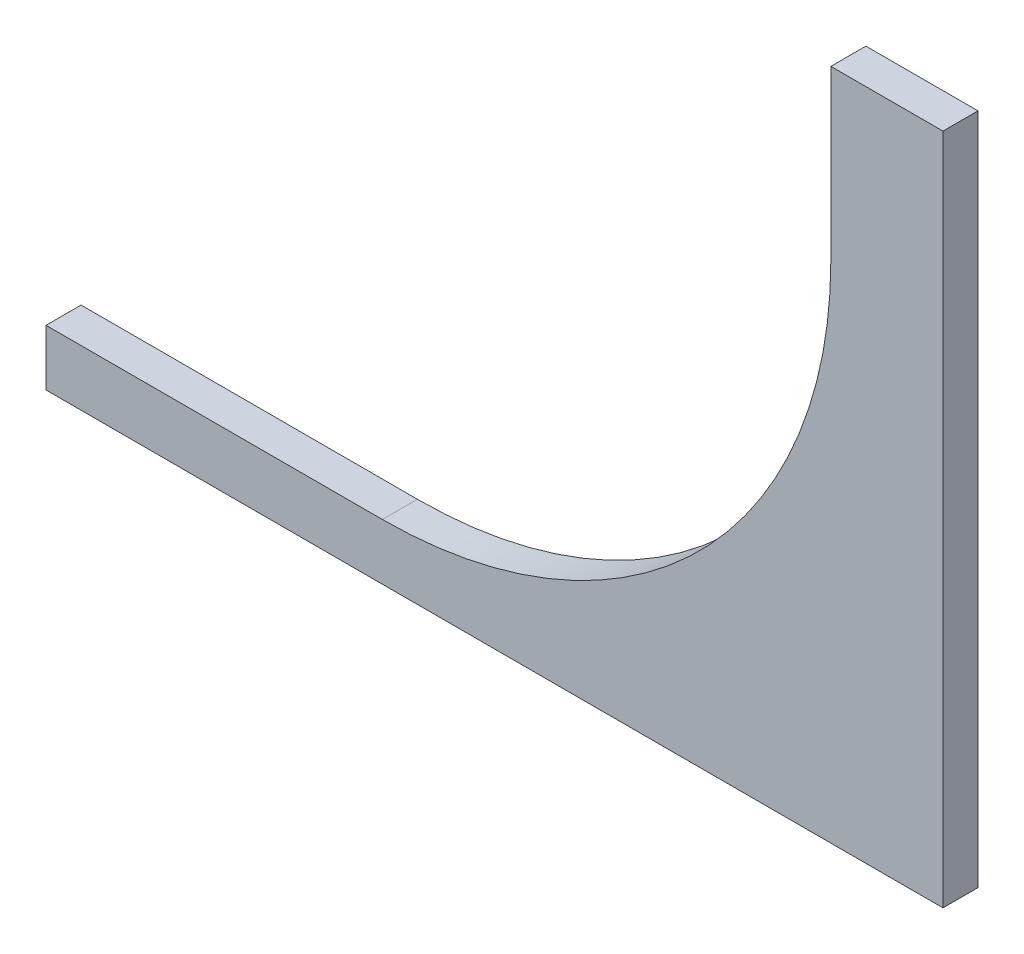
ISO-10303-21;
HEADER;
FILE_DESCRIPTION(('STEP AP214'),'2;1');
FILE_NAME('part.step','',(''),(''),'','','');
FILE_SCHEMA(('AUTOMOTIVE_DESIGN { 1 0 10303 214 1 1 1 1 }'));
ENDSEC;
DATA;
#1=APPLICATION_CONTEXT('core data for automotive mechanical design processes');
#2=APPLICATION_PROTOCOL_DEFINITION('international standard','automotive_design',2000,#1);
#3=PRODUCT_CONTEXT('',#1,'mechanical');
#4=PRODUCT('Part','Part','',(#3));
#5=PRODUCT_RELATED_PRODUCT_CATEGORY('part','',(#4));
#6=PRODUCT_DEFINITION_FORMATION('','',#4);
#7=PRODUCT_DEFINITION_CONTEXT('part definition',#1,'design');
#8=PRODUCT_DEFINITION('design','',#6,#7);
#9=PRODUCT_DEFINITION_SHAPE('','',#8);
#10=(LENGTH_UNIT() NAMED_UNIT(*) SI_UNIT(.MILLI.,.METRE.));
#11=(NAMED_UNIT(*) PLANE_ANGLE_UNIT() SI_UNIT($,.RADIAN.));
#12=(NAMED_UNIT(*) SI_UNIT($,.STERADIAN.) SOLID_ANGLE_UNIT());
#13=UNCERTAINTY_MEASURE_WITH_UNIT(LENGTH_MEASURE(1.E-05),#10,'distance_accuracy_value','');
#14=(GEOMETRIC_REPRESENTATION_CONTEXT(3) GLOBAL_UNCERTAINTY_ASSIGNED_CONTEXT((#13)) GLOBAL_UNIT_ASSIGNED_CONTEXT((#10,
#11,#12)) REPRESENTATION_CONTEXT('',''));
#15=CARTESIAN_POINT('',(0.,0.,0.));
#16=DIRECTION('',(0.,0.,1.));
#17=DIRECTION('',(1.,0.,0.));
#18=AXIS2_PLACEMENT_3D('',#15,#16,#17);
#19=CARTESIAN_POINT('',(0.,0.,15.875));
#20=DIRECTION('',(1.,0.,0.));
#21=DIRECTION('',(0.,0.,-1.));
#22=AXIS2_PLACEMENT_3D('',#19,#20,#21);
#23=PLANE('',#22);
#24=DIRECTION('',(0.,-1.,0.));
#25=VECTOR('',#24,1.);
#26=CARTESIAN_POINT('',(0.,0.,15.875));
#27=LINE('',#26,#25);
#28=CARTESIAN_POINT('',(0.,25.4,15.875));
#29=VERTEX_POINT('',#28);
#30=CARTESIAN_POINT('',(0.,0.,15.875));
#31=VERTEX_POINT('',#30);
#32=EDGE_CURVE('E77',#29,#31,#27,.T.);
#33=ORIENTED_EDGE('',*,*,#32,.F.);
#34=DIRECTION('',(0.,0.,1.));
#35=VECTOR('',#34,1.);
#36=CARTESIAN_POINT('',(0.,25.4,0.));
#37=LINE('',#36,#35);
#38=CARTESIAN_POINT('',(0.,25.4,0.));
#39=VERTEX_POINT('',#38);
#40=EDGE_CURVE('E103',#39,#29,#37,.T.);
#41=ORIENTED_EDGE('',*,*,#40,.F.);
#42=DIRECTION('',(0.,-1.,0.));
#43=VECTOR('',#42,1.);
#44=CARTESIAN_POINT('',(0.,0.,0.));
#45=LINE('',#44,#43);
#46=CARTESIAN_POINT('',(0.,0.,0.));
#47=VERTEX_POINT('',#46);
#48=EDGE_CURVE('E111',#39,#47,#45,.T.);
#49=ORIENTED_EDGE('',*,*,#48,.T.);
#50=DIRECTION('',(0.,0.,-1.));
#51=VECTOR('',#50,1.);
#52=CARTESIAN_POINT('',(0.,0.,15.875));
#53=LINE('',#52,#51);
#54=EDGE_CURVE('E11',#31,#47,#53,.T.);
#55=ORIENTED_EDGE('',*,*,#54,.F.);
#56=EDGE_LOOP('',(#33,#41,#49,#55));
#57=FACE_BOUND('',#56,.T.);
#58=ADVANCED_FACE('F32',(#57),#23,.F.);
#59=CARTESIAN_POINT('',(0.,0.,15.875));
#60=DIRECTION('',(0.,1.,0.));
#61=DIRECTION('',(0.,0.,1.));
#62=AXIS2_PLACEMENT_3D('',#59,#60,#61);
#63=PLANE('',#62);
#64=DIRECTION('',(1.,0.,0.));
#65=VECTOR('',#64,1.);
#66=CARTESIAN_POINT('',(0.,0.,0.));
#67=LINE('',#66,#65);
#68=CARTESIAN_POINT('',(406.4,0.,0.));
#69=VERTEX_POINT('',#68);
#70=EDGE_CURVE('E117',#47,#69,#67,.T.);
#71=ORIENTED_EDGE('',*,*,#70,.T.);
#72=DIRECTION('',(0.,0.,-1.));
#73=VECTOR('',#72,1.);
#74=CARTESIAN_POINT('',(406.4,0.,15.875));
#75=LINE('',#74,#73);
#76=CARTESIAN_POINT('',(406.4,0.,15.875));
#77=VERTEX_POINT('',#76);
#78=EDGE_CURVE('E39',#77,#69,#75,.T.);
#79=ORIENTED_EDGE('',*,*,#78,.F.);
#80=DIRECTION('',(1.,0.,0.));
#81=VECTOR('',#80,1.);
#82=CARTESIAN_POINT('',(0.,0.,15.875));
#83=LINE('',#82,#81);
#84=EDGE_CURVE('E142',#31,#77,#83,.T.);
#85=ORIENTED_EDGE('',*,*,#84,.F.);
#86=ORIENTED_EDGE('',*,*,#54,.T.);
#87=EDGE_LOOP('',(#71,#79,#85,#86));
#88=FACE_BOUND('',#87,.T.);
#89=ADVANCED_FACE('F169',(#88),#63,.F.);
#90=CARTESIAN_POINT('',(406.4,0.,15.875));
#91=DIRECTION('',(-1.,0.,0.));
#92=DIRECTION('',(0.,0.,1.));
#93=AXIS2_PLACEMENT_3D('',#90,#91,#92);
#94=PLANE('',#93);
#95=DIRECTION('',(0.,1.,0.));
#96=VECTOR('',#95,1.);
#97=CARTESIAN_POINT('',(406.4,0.,0.));
#98=LINE('',#97,#96);
#99=CARTESIAN_POINT('',(406.4,304.8,0.));
#100=VERTEX_POINT('',#99);
#101=EDGE_CURVE('E72',#69,#100,#98,.T.);
#102=ORIENTED_EDGE('',*,*,#101,.T.);
#103=DIRECTION('',(0.,0.,-1.));
#104=VECTOR('',#103,1.);
#105=CARTESIAN_POINT('',(406.4,304.8,15.875));
#106=LINE('',#105,#104);
#107=CARTESIAN_POINT('',(406.4,304.8,15.875));
#108=VERTEX_POINT('',#107);
#109=EDGE_CURVE('E132',#108,#100,#106,.T.);
#110=ORIENTED_EDGE('',*,*,#109,.F.);
#111=DIRECTION('',(0.,1.,0.));
#112=VECTOR('',#111,1.);
#113=CARTESIAN_POINT('',(406.4,0.,15.875));
#114=LINE('',#113,#112);
#115=EDGE_CURVE('E55',#77,#108,#114,.T.);
#116=ORIENTED_EDGE('',*,*,#115,.F.);
#117=ORIENTED_EDGE('',*,*,#78,.T.);
#118=EDGE_LOOP('',(#102,#110,#116,#117));
#119=FACE_BOUND('',#118,.T.);
#120=ADVANCED_FACE('F134',(#119),#94,.F.);
#121=CARTESIAN_POINT('',(0.,304.8,15.875));
#122=DIRECTION('',(0.,-1.,0.));
#123=DIRECTION('',(0.,0.,-1.));
#124=AXIS2_PLACEMENT_3D('',#121,#122,#123);
#125=PLANE('',#124);
#126=DIRECTION('',(-1.,0.,0.));
#127=VECTOR('',#126,1.);
#128=CARTESIAN_POINT('',(0.,304.8,0.));
#129=LINE('',#128,#127);
#130=CARTESIAN_POINT('',(355.6,304.8,0.));
#131=VERTEX_POINT('',#130);
#132=EDGE_CURVE('E129',#100,#131,#129,.T.);
#133=ORIENTED_EDGE('',*,*,#132,.T.);
#134=DIRECTION('',(0.,0.,1.));
#135=VECTOR('',#134,1.);
#136=CARTESIAN_POINT('',(355.6,304.8,0.));
#137=LINE('',#136,#135);
#138=CARTESIAN_POINT('',(355.6,304.8,15.875));
#139=VERTEX_POINT('',#138);
#140=EDGE_CURVE('E118',#131,#139,#137,.T.);
#141=ORIENTED_EDGE('',*,*,#140,.T.);
#142=DIRECTION('',(-1.,0.,0.));
#143=VECTOR('',#142,1.);
#144=CARTESIAN_POINT('',(0.,304.8,15.875));
#145=LINE('',#144,#143);
#146=EDGE_CURVE('E125',#108,#139,#145,.T.);
#147=ORIENTED_EDGE('',*,*,#146,.F.);
#148=ORIENTED_EDGE('',*,*,#109,.T.);
#149=EDGE_LOOP('',(#133,#141,#147,#148));
#150=FACE_BOUND('',#149,.T.);
#151=ADVANCED_FACE('F139',(#150),#125,.F.);
#152=CARTESIAN_POINT('',(0.,0.,15.875));
#153=DIRECTION('',(0.,0.,-1.));
#154=DIRECTION('',(-1.,0.,0.));
#155=AXIS2_PLACEMENT_3D('',#152,#153,#154);
#156=PLANE('',#155);
#157=ORIENTED_EDGE('',*,*,#146,.T.);
#158=DIRECTION('',(0.,1.,0.));
#159=VECTOR('',#158,1.);
#160=CARTESIAN_POINT('',(355.6,228.6,15.875));
#161=LINE('',#160,#159);
#162=CARTESIAN_POINT('',(355.6,228.6,15.875));
#163=VERTEX_POINT('',#162);
#164=EDGE_CURVE('E107',#163,#139,#161,.T.);
#165=ORIENTED_EDGE('',*,*,#164,.F.);
#166=CARTESIAN_POINT('',(152.4,228.6,15.875));
#167=DIRECTION('',(0.,0.,1.));
#168=DIRECTION('',(1.,0.,0.));
#169=AXIS2_PLACEMENT_3D('',#166,#167,#168);
#170=CIRCLE('',#169,203.2);
#171=CARTESIAN_POINT('',(152.4,25.3999999999999,15.875));
#172=VERTEX_POINT('',#171);
#173=EDGE_CURVE('E149',#172,#163,#170,.T.);
#174=ORIENTED_EDGE('',*,*,#173,.F.);
#175=DIRECTION('',(1.,0.,0.));
#176=VECTOR('',#175,1.);
#177=CARTESIAN_POINT('',(152.4,25.3999999999999,15.875));
#178=LINE('',#177,#176);
#179=EDGE_CURVE('E152',#29,#172,#178,.T.);
#180=ORIENTED_EDGE('',*,*,#179,.F.);
#181=ORIENTED_EDGE('',*,*,#32,.T.);
#182=ORIENTED_EDGE('',*,*,#84,.T.);
#183=ORIENTED_EDGE('',*,*,#115,.T.);
#184=EDGE_LOOP('',(#157,#165,#174,#180,#181,#182,#183));
#185=FACE_BOUND('',#184,.T.);
#186=ADVANCED_FACE('F156',(#185),#156,.F.);
#187=CARTESIAN_POINT('',(0.,0.,0.));
#188=DIRECTION('',(0.,0.,-1.));
#189=DIRECTION('',(-1.,0.,0.));
#190=AXIS2_PLACEMENT_3D('',#187,#188,#189);
#191=PLANE('',#190);
#192=DIRECTION('',(0.,1.,0.));
#193=VECTOR('',#192,1.);
#194=CARTESIAN_POINT('',(355.6,228.6,0.));
#195=LINE('',#194,#193);
#196=CARTESIAN_POINT('',(355.6,228.6,0.));
#197=VERTEX_POINT('',#196);
#198=EDGE_CURVE('E113',#197,#131,#195,.T.);
#199=ORIENTED_EDGE('',*,*,#198,.T.);
#200=ORIENTED_EDGE('',*,*,#132,.F.);
#201=ORIENTED_EDGE('',*,*,#101,.F.);
#202=ORIENTED_EDGE('',*,*,#70,.F.);
#203=ORIENTED_EDGE('',*,*,#48,.F.);
#204=DIRECTION('',(1.,0.,0.));
#205=VECTOR('',#204,1.);
#206=CARTESIAN_POINT('',(152.4,25.3999999999999,0.));
#207=LINE('',#206,#205);
#208=CARTESIAN_POINT('',(152.4,25.3999999999999,0.));
#209=VERTEX_POINT('',#208);
#210=EDGE_CURVE('E99',#39,#209,#207,.T.);
#211=ORIENTED_EDGE('',*,*,#210,.T.);
#212=CARTESIAN_POINT('',(152.4,228.6,0.));
#213=DIRECTION('',(0.,0.,1.));
#214=DIRECTION('',(1.,0.,0.));
#215=AXIS2_PLACEMENT_3D('',#212,#213,#214);
#216=CIRCLE('',#215,203.2);
#217=EDGE_CURVE('E46',#209,#197,#216,.T.);
#218=ORIENTED_EDGE('',*,*,#217,.T.);
#219=EDGE_LOOP('',(#199,#200,#201,#202,#203,#211,#218));
#220=FACE_BOUND('',#219,.T.);
#221=ADVANCED_FACE('F116',(#220),#191,.T.);
#222=CARTESIAN_POINT('',(355.6,228.6,0.));
#223=DIRECTION('',(1.,0.,0.));
#224=DIRECTION('',(0.,0.,-1.));
#225=AXIS2_PLACEMENT_3D('',#222,#223,#224);
#226=PLANE('',#225);
#227=ORIENTED_EDGE('',*,*,#164,.T.);
#228=ORIENTED_EDGE('',*,*,#140,.F.);
#229=ORIENTED_EDGE('',*,*,#198,.F.);
#230=DIRECTION('',(0.,0.,1.));
#231=VECTOR('',#230,1.);
#232=CARTESIAN_POINT('',(355.6,228.6,0.));
#233=LINE('',#232,#231);
#234=EDGE_CURVE('E122',#197,#163,#233,.T.);
#235=ORIENTED_EDGE('',*,*,#234,.T.);
#236=EDGE_LOOP('',(#227,#228,#229,#235));
#237=FACE_BOUND('',#236,.T.);
#238=ADVANCED_FACE('F159',(#237),#226,.F.);
#239=CARTESIAN_POINT('',(152.4,228.6,0.));
#240=DIRECTION('',(0.,0.,1.));
#241=DIRECTION('',(1.,0.,0.));
#242=AXIS2_PLACEMENT_3D('',#239,#240,#241);
#243=CYLINDRICAL_SURFACE('',#242,203.2);
#244=ORIENTED_EDGE('',*,*,#173,.T.);
#245=ORIENTED_EDGE('',*,*,#234,.F.);
#246=ORIENTED_EDGE('',*,*,#217,.F.);
#247=DIRECTION('',(0.,0.,1.));
#248=VECTOR('',#247,1.);
#249=CARTESIAN_POINT('',(152.4,25.3999999999999,0.));
#250=LINE('',#249,#248);
#251=EDGE_CURVE('E104',#209,#172,#250,.T.);
#252=ORIENTED_EDGE('',*,*,#251,.T.);
#253=EDGE_LOOP('',(#244,#245,#246,#252));
#254=FACE_BOUND('',#253,.T.);
#255=ADVANCED_FACE('F157',(#254),#243,.F.);
#256=CARTESIAN_POINT('',(152.4,25.3999999999999,0.));
#257=DIRECTION('',(0.,-1.,0.));
#258=DIRECTION('',(1.,0.,0.));
#259=AXIS2_PLACEMENT_3D('',#256,#257,#258);
#260=PLANE('',#259);
#261=ORIENTED_EDGE('',*,*,#179,.T.);
#262=ORIENTED_EDGE('',*,*,#251,.F.);
#263=ORIENTED_EDGE('',*,*,#210,.F.);
#264=ORIENTED_EDGE('',*,*,#40,.T.);
#265=EDGE_LOOP('',(#261,#262,#263,#264));
#266=FACE_BOUND('',#265,.T.);
#267=ADVANCED_FACE('F102',(#266),#260,.F.);
#268=CLOSED_SHELL('',(#58,#89,#120,#151,#186,#221,#238,#255,#267));
#269=MANIFOLD_SOLID_BREP('B2',#268);
#270=ADVANCED_BREP_SHAPE_REPRESENTATION('',(#18,#269),#14);
#271=SHAPE_DEFINITION_REPRESENTATION(#9,#270);
ENDSEC;
END-ISO-10303-21;
